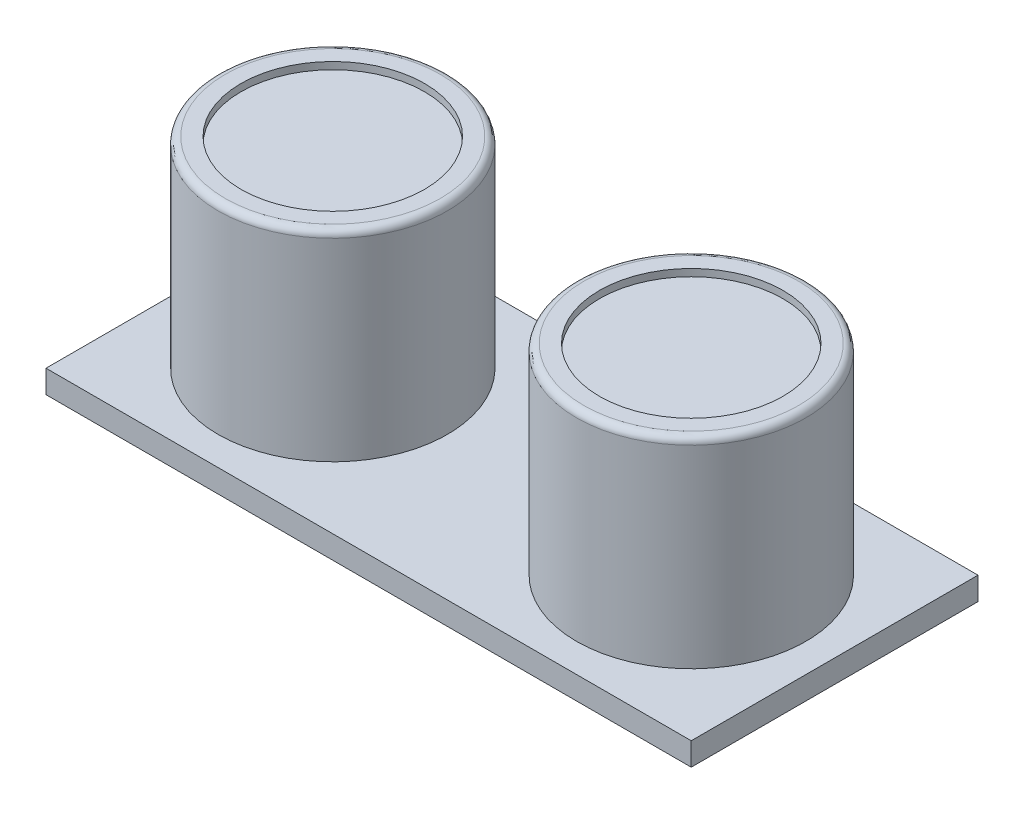
ISO-10303-21;
HEADER;
FILE_DESCRIPTION(('STEP AP214'),'2;1');
FILE_NAME('part.step','',(''),(''),'','','');
FILE_SCHEMA(('AUTOMOTIVE_DESIGN { 1 0 10303 214 1 1 1 1 }'));
ENDSEC;
DATA;
#1=APPLICATION_CONTEXT('core data for automotive mechanical design processes');
#2=APPLICATION_PROTOCOL_DEFINITION('international standard','automotive_design',2000,#1);
#3=PRODUCT_CONTEXT('',#1,'mechanical');
#4=PRODUCT('Part','Part','',(#3));
#5=PRODUCT_RELATED_PRODUCT_CATEGORY('part','',(#4));
#6=PRODUCT_DEFINITION_FORMATION('','',#4);
#7=PRODUCT_DEFINITION_CONTEXT('part definition',#1,'design');
#8=PRODUCT_DEFINITION('design','',#6,#7);
#9=PRODUCT_DEFINITION_SHAPE('','',#8);
#10=(LENGTH_UNIT() NAMED_UNIT(*) SI_UNIT(.MILLI.,.METRE.));
#11=(NAMED_UNIT(*) PLANE_ANGLE_UNIT() SI_UNIT($,.RADIAN.));
#12=(NAMED_UNIT(*) SI_UNIT($,.STERADIAN.) SOLID_ANGLE_UNIT());
#13=UNCERTAINTY_MEASURE_WITH_UNIT(LENGTH_MEASURE(1.E-05),#10,'distance_accuracy_value','');
#14=(GEOMETRIC_REPRESENTATION_CONTEXT(3) GLOBAL_UNCERTAINTY_ASSIGNED_CONTEXT((#13)) GLOBAL_UNIT_ASSIGNED_CONTEXT((#10,
#11,#12)) REPRESENTATION_CONTEXT('',''));
#15=CARTESIAN_POINT('',(0.,0.,0.));
#16=DIRECTION('',(0.,0.,1.));
#17=DIRECTION('',(1.,0.,0.));
#18=AXIS2_PLACEMENT_3D('',#15,#16,#17);
#19=CARTESIAN_POINT('',(0.,1.6,0.));
#20=DIRECTION('',(1.,0.,0.));
#21=DIRECTION('',(0.,0.,-1.));
#22=AXIS2_PLACEMENT_3D('',#19,#20,#21);
#23=PLANE('',#22);
#24=DIRECTION('',(0.,0.,1.));
#25=VECTOR('',#24,1.);
#26=CARTESIAN_POINT('',(0.,0.,0.));
#27=LINE('',#26,#25);
#28=CARTESIAN_POINT('',(0.,0.,-20.));
#29=VERTEX_POINT('',#28);
#30=CARTESIAN_POINT('',(0.,0.,0.));
#31=VERTEX_POINT('',#30);
#32=EDGE_CURVE('E102',#29,#31,#27,.T.);
#33=ORIENTED_EDGE('',*,*,#32,.T.);
#34=DIRECTION('',(0.,-1.,0.));
#35=VECTOR('',#34,1.);
#36=CARTESIAN_POINT('',(0.,1.6,0.));
#37=LINE('',#36,#35);
#38=CARTESIAN_POINT('',(0.,1.6,0.));
#39=VERTEX_POINT('',#38);
#40=EDGE_CURVE('E93',#39,#31,#37,.T.);
#41=ORIENTED_EDGE('',*,*,#40,.F.);
#42=DIRECTION('',(0.,0.,1.));
#43=VECTOR('',#42,1.);
#44=CARTESIAN_POINT('',(0.,1.6,0.));
#45=LINE('',#44,#43);
#46=CARTESIAN_POINT('',(0.,1.6,-20.));
#47=VERTEX_POINT('',#46);
#48=EDGE_CURVE('E87',#47,#39,#45,.T.);
#49=ORIENTED_EDGE('',*,*,#48,.F.);
#50=DIRECTION('',(0.,-1.,0.));
#51=VECTOR('',#50,1.);
#52=CARTESIAN_POINT('',(0.,1.6,-20.));
#53=LINE('',#52,#51);
#54=EDGE_CURVE('E98',#47,#29,#53,.T.);
#55=ORIENTED_EDGE('',*,*,#54,.T.);
#56=EDGE_LOOP('',(#33,#41,#49,#55));
#57=FACE_BOUND('',#56,.T.);
#58=ADVANCED_FACE('F34',(#57),#23,.F.);
#59=CARTESIAN_POINT('',(0.,1.6,0.));
#60=DIRECTION('',(0.,0.,-1.));
#61=DIRECTION('',(-1.,0.,0.));
#62=AXIS2_PLACEMENT_3D('',#59,#60,#61);
#63=PLANE('',#62);
#64=DIRECTION('',(1.,0.,0.));
#65=VECTOR('',#64,1.);
#66=CARTESIAN_POINT('',(0.,0.,0.));
#67=LINE('',#66,#65);
#68=CARTESIAN_POINT('',(45.,0.,0.));
#69=VERTEX_POINT('',#68);
#70=EDGE_CURVE('E92',#31,#69,#67,.T.);
#71=ORIENTED_EDGE('',*,*,#70,.T.);
#72=DIRECTION('',(0.,-1.,0.));
#73=VECTOR('',#72,1.);
#74=CARTESIAN_POINT('',(45.,1.6,0.));
#75=LINE('',#74,#73);
#76=CARTESIAN_POINT('',(45.,1.6,0.));
#77=VERTEX_POINT('',#76);
#78=EDGE_CURVE('E90',#77,#69,#75,.T.);
#79=ORIENTED_EDGE('',*,*,#78,.F.);
#80=DIRECTION('',(1.,0.,0.));
#81=VECTOR('',#80,1.);
#82=CARTESIAN_POINT('',(0.,1.6,0.));
#83=LINE('',#82,#81);
#84=EDGE_CURVE('E82',#39,#77,#83,.T.);
#85=ORIENTED_EDGE('',*,*,#84,.F.);
#86=ORIENTED_EDGE('',*,*,#40,.T.);
#87=EDGE_LOOP('',(#71,#79,#85,#86));
#88=FACE_BOUND('',#87,.T.);
#89=ADVANCED_FACE('F91',(#88),#63,.F.);
#90=CARTESIAN_POINT('',(45.,1.6,0.));
#91=DIRECTION('',(-1.,0.,0.));
#92=DIRECTION('',(0.,0.,1.));
#93=AXIS2_PLACEMENT_3D('',#90,#91,#92);
#94=PLANE('',#93);
#95=DIRECTION('',(0.,0.,-1.));
#96=VECTOR('',#95,1.);
#97=CARTESIAN_POINT('',(45.,0.,0.));
#98=LINE('',#97,#96);
#99=CARTESIAN_POINT('',(45.,0.,-20.));
#100=VERTEX_POINT('',#99);
#101=EDGE_CURVE('E68',#69,#100,#98,.T.);
#102=ORIENTED_EDGE('',*,*,#101,.T.);
#103=DIRECTION('',(0.,-1.,0.));
#104=VECTOR('',#103,1.);
#105=CARTESIAN_POINT('',(45.,1.6,-20.));
#106=LINE('',#105,#104);
#107=CARTESIAN_POINT('',(45.,1.6,-20.));
#108=VERTEX_POINT('',#107);
#109=EDGE_CURVE('E94',#108,#100,#106,.T.);
#110=ORIENTED_EDGE('',*,*,#109,.F.);
#111=DIRECTION('',(0.,0.,-1.));
#112=VECTOR('',#111,1.);
#113=CARTESIAN_POINT('',(45.,1.6,0.));
#114=LINE('',#113,#112);
#115=EDGE_CURVE('E85',#77,#108,#114,.T.);
#116=ORIENTED_EDGE('',*,*,#115,.F.);
#117=ORIENTED_EDGE('',*,*,#78,.T.);
#118=EDGE_LOOP('',(#102,#110,#116,#117));
#119=FACE_BOUND('',#118,.T.);
#120=ADVANCED_FACE('F96',(#119),#94,.F.);
#121=CARTESIAN_POINT('',(0.,1.6,-20.));
#122=DIRECTION('',(0.,0.,1.));
#123=DIRECTION('',(1.,0.,0.));
#124=AXIS2_PLACEMENT_3D('',#121,#122,#123);
#125=PLANE('',#124);
#126=DIRECTION('',(-1.,0.,0.));
#127=VECTOR('',#126,1.);
#128=CARTESIAN_POINT('',(0.,0.,-20.));
#129=LINE('',#128,#127);
#130=EDGE_CURVE('E74',#100,#29,#129,.T.);
#131=ORIENTED_EDGE('',*,*,#130,.T.);
#132=ORIENTED_EDGE('',*,*,#54,.F.);
#133=DIRECTION('',(-1.,0.,0.));
#134=VECTOR('',#133,1.);
#135=CARTESIAN_POINT('',(0.,1.6,-20.));
#136=LINE('',#135,#134);
#137=EDGE_CURVE('E51',#108,#47,#136,.T.);
#138=ORIENTED_EDGE('',*,*,#137,.F.);
#139=ORIENTED_EDGE('',*,*,#109,.T.);
#140=EDGE_LOOP('',(#131,#132,#138,#139));
#141=FACE_BOUND('',#140,.T.);
#142=ADVANCED_FACE('F148',(#141),#125,.F.);
#143=CARTESIAN_POINT('',(0.,1.6,0.));
#144=DIRECTION('',(0.,-1.,0.));
#145=DIRECTION('',(0.,0.,-1.));
#146=AXIS2_PLACEMENT_3D('',#143,#144,#145);
#147=PLANE('',#146);
#148=CARTESIAN_POINT('',(35.,1.6,-10.));
#149=DIRECTION('',(0.,-1.,0.));
#150=DIRECTION('',(0.,0.,-1.));
#151=AXIS2_PLACEMENT_3D('',#148,#149,#150);
#152=CIRCLE('',#151,8.);
#153=CARTESIAN_POINT('',(35.,1.6,-18.));
#154=VERTEX_POINT('',#153);
#155=EDGE_CURVE('E115',#154,#154,#152,.F.);
#156=ORIENTED_EDGE('',*,*,#155,.F.);
#157=EDGE_LOOP('',(#156));
#158=FACE_BOUND('',#157,.T.);
#159=CARTESIAN_POINT('',(10.,1.6,-10.));
#160=DIRECTION('',(0.,-1.,0.));
#161=DIRECTION('',(0.,0.,-1.));
#162=AXIS2_PLACEMENT_3D('',#159,#160,#161);
#163=CIRCLE('',#162,8.);
#164=CARTESIAN_POINT('',(10.,1.6,-18.));
#165=VERTEX_POINT('',#164);
#166=EDGE_CURVE('E112',#165,#165,#163,.F.);
#167=ORIENTED_EDGE('',*,*,#166,.F.);
#168=EDGE_LOOP('',(#167));
#169=FACE_BOUND('',#168,.T.);
#170=ORIENTED_EDGE('',*,*,#48,.T.);
#171=ORIENTED_EDGE('',*,*,#84,.T.);
#172=ORIENTED_EDGE('',*,*,#115,.T.);
#173=ORIENTED_EDGE('',*,*,#137,.T.);
#174=EDGE_LOOP('',(#170,#171,#172,#173));
#175=FACE_BOUND('',#174,.T.);
#176=ADVANCED_FACE('F83',(#158,#169,#175),#147,.F.);
#177=CARTESIAN_POINT('',(0.,0.,0.));
#178=DIRECTION('',(0.,-1.,0.));
#179=DIRECTION('',(0.,0.,-1.));
#180=AXIS2_PLACEMENT_3D('',#177,#178,#179);
#181=PLANE('',#180);
#182=ORIENTED_EDGE('',*,*,#32,.F.);
#183=ORIENTED_EDGE('',*,*,#130,.F.);
#184=ORIENTED_EDGE('',*,*,#101,.F.);
#185=ORIENTED_EDGE('',*,*,#70,.F.);
#186=EDGE_LOOP('',(#182,#183,#184,#185));
#187=FACE_BOUND('',#186,.T.);
#188=ADVANCED_FACE('F151',(#187),#181,.T.);
#189=CARTESIAN_POINT('',(10.,15.6,-10.));
#190=DIRECTION('',(0.,-1.,0.));
#191=DIRECTION('',(0.,0.,-1.));
#192=AXIS2_PLACEMENT_3D('',#189,#190,#191);
#193=CYLINDRICAL_SURFACE('',#192,8.);
#194=CARTESIAN_POINT('',(10.,15.1,-10.));
#195=DIRECTION('',(0.,1.,0.));
#196=DIRECTION('',(0.,0.,1.));
#197=AXIS2_PLACEMENT_3D('',#194,#195,#196);
#198=CIRCLE('',#197,8.);
#199=CARTESIAN_POINT('',(10.,15.1,-2.));
#200=VERTEX_POINT('',#199);
#201=EDGE_CURVE('E11',#200,#200,#198,.F.);
#202=ORIENTED_EDGE('',*,*,#201,.T.);
#203=EDGE_LOOP('',(#202));
#204=FACE_BOUND('',#203,.T.);
#205=ORIENTED_EDGE('',*,*,#166,.T.);
#206=EDGE_LOOP('',(#205));
#207=FACE_BOUND('',#206,.T.);
#208=ADVANCED_FACE('F154',(#204,#207),#193,.T.);
#209=CARTESIAN_POINT('',(10.,15.6,-10.));
#210=DIRECTION('',(0.,1.,0.));
#211=DIRECTION('',(0.,0.,1.));
#212=AXIS2_PLACEMENT_3D('',#209,#210,#211);
#213=PLANE('',#212);
#214=CARTESIAN_POINT('',(10.,15.6,-10.));
#215=DIRECTION('',(0.,1.,0.));
#216=DIRECTION('',(0.,0.,1.));
#217=AXIS2_PLACEMENT_3D('',#214,#215,#216);
#218=CIRCLE('',#217,7.5);
#219=CARTESIAN_POINT('',(10.,15.6,-2.5));
#220=VERTEX_POINT('',#219);
#221=EDGE_CURVE('E43',#220,#220,#218,.T.);
#222=ORIENTED_EDGE('',*,*,#221,.T.);
#223=EDGE_LOOP('',(#222));
#224=FACE_BOUND('',#223,.T.);
#225=CARTESIAN_POINT('',(10.,15.6,-10.));
#226=DIRECTION('',(0.,1.,0.));
#227=DIRECTION('',(0.,0.,1.));
#228=AXIS2_PLACEMENT_3D('',#225,#226,#227);
#229=CIRCLE('',#228,6.4);
#230=CARTESIAN_POINT('',(10.,15.6,-3.6));
#231=VERTEX_POINT('',#230);
#232=EDGE_CURVE('E190',#231,#231,#229,.T.);
#233=ORIENTED_EDGE('',*,*,#232,.F.);
#234=EDGE_LOOP('',(#233));
#235=FACE_BOUND('',#234,.T.);
#236=ADVANCED_FACE('F126',(#224,#235),#213,.T.);
#237=CARTESIAN_POINT('',(35.,15.6,-10.));
#238=DIRECTION('',(0.,-1.,0.));
#239=DIRECTION('',(0.,0.,-1.));
#240=AXIS2_PLACEMENT_3D('',#237,#238,#239);
#241=CYLINDRICAL_SURFACE('',#240,8.);
#242=CARTESIAN_POINT('',(35.,15.1,-10.));
#243=DIRECTION('',(0.,1.,0.));
#244=DIRECTION('',(0.,0.,1.));
#245=AXIS2_PLACEMENT_3D('',#242,#243,#244);
#246=CIRCLE('',#245,8.);
#247=CARTESIAN_POINT('',(35.,15.1,-2.));
#248=VERTEX_POINT('',#247);
#249=EDGE_CURVE('E121',#248,#248,#246,.F.);
#250=ORIENTED_EDGE('',*,*,#249,.T.);
#251=EDGE_LOOP('',(#250));
#252=FACE_BOUND('',#251,.T.);
#253=ORIENTED_EDGE('',*,*,#155,.T.);
#254=EDGE_LOOP('',(#253));
#255=FACE_BOUND('',#254,.T.);
#256=ADVANCED_FACE('F164',(#252,#255),#241,.T.);
#257=CARTESIAN_POINT('',(35.,15.6,-10.));
#258=DIRECTION('',(0.,1.,0.));
#259=DIRECTION('',(0.,0.,1.));
#260=AXIS2_PLACEMENT_3D('',#257,#258,#259);
#261=PLANE('',#260);
#262=CARTESIAN_POINT('',(35.,15.6,-10.));
#263=DIRECTION('',(0.,1.,0.));
#264=DIRECTION('',(0.,0.,1.));
#265=AXIS2_PLACEMENT_3D('',#262,#263,#264);
#266=CIRCLE('',#265,7.5);
#267=CARTESIAN_POINT('',(35.,15.6,-2.5));
#268=VERTEX_POINT('',#267);
#269=EDGE_CURVE('E118',#268,#268,#266,.T.);
#270=ORIENTED_EDGE('',*,*,#269,.T.);
#271=EDGE_LOOP('',(#270));
#272=FACE_BOUND('',#271,.T.);
#273=CARTESIAN_POINT('',(35.,15.6,-10.));
#274=DIRECTION('',(0.,1.,0.));
#275=DIRECTION('',(0.,0.,1.));
#276=AXIS2_PLACEMENT_3D('',#273,#274,#275);
#277=CIRCLE('',#276,6.39999999999999);
#278=CARTESIAN_POINT('',(35.,15.6,-3.60000000000001));
#279=VERTEX_POINT('',#278);
#280=EDGE_CURVE('E198',#279,#279,#277,.T.);
#281=ORIENTED_EDGE('',*,*,#280,.F.);
#282=EDGE_LOOP('',(#281));
#283=FACE_BOUND('',#282,.T.);
#284=ADVANCED_FACE('F167',(#272,#283),#261,.T.);
#285=CARTESIAN_POINT('',(35.,15.1,-10.));
#286=DIRECTION('',(0.,1.,0.));
#287=DIRECTION('',(0.,0.,1.));
#288=AXIS2_PLACEMENT_3D('',#285,#286,#287);
#289=CYLINDRICAL_SURFACE('',#288,6.39999999999999);
#290=CARTESIAN_POINT('',(35.,15.1,-10.));
#291=DIRECTION('',(0.,1.,0.));
#292=DIRECTION('',(0.,0.,1.));
#293=AXIS2_PLACEMENT_3D('',#290,#291,#292);
#294=CIRCLE('',#293,6.39999999999999);
#295=CARTESIAN_POINT('',(35.,15.1,-3.60000000000001));
#296=VERTEX_POINT('',#295);
#297=EDGE_CURVE('E193',#296,#296,#294,.T.);
#298=ORIENTED_EDGE('',*,*,#297,.F.);
#299=EDGE_LOOP('',(#298));
#300=FACE_BOUND('',#299,.T.);
#301=ORIENTED_EDGE('',*,*,#280,.T.);
#302=EDGE_LOOP('',(#301));
#303=FACE_BOUND('',#302,.T.);
#304=ADVANCED_FACE('F171',(#300,#303),#289,.F.);
#305=CARTESIAN_POINT('',(35.,15.1,-10.));
#306=DIRECTION('',(0.,1.,0.));
#307=DIRECTION('',(0.,0.,1.));
#308=AXIS2_PLACEMENT_3D('',#305,#306,#307);
#309=PLANE('',#308);
#310=ORIENTED_EDGE('',*,*,#297,.T.);
#311=EDGE_LOOP('',(#310));
#312=FACE_BOUND('',#311,.T.);
#313=ADVANCED_FACE('F175',(#312),#309,.T.);
#314=CARTESIAN_POINT('',(10.,15.1,-10.));
#315=DIRECTION('',(0.,1.,0.));
#316=DIRECTION('',(0.,0.,1.));
#317=AXIS2_PLACEMENT_3D('',#314,#315,#316);
#318=CYLINDRICAL_SURFACE('',#317,6.4);
#319=CARTESIAN_POINT('',(10.,15.1,-10.));
#320=DIRECTION('',(0.,1.,0.));
#321=DIRECTION('',(0.,0.,1.));
#322=AXIS2_PLACEMENT_3D('',#319,#320,#321);
#323=CIRCLE('',#322,6.4);
#324=CARTESIAN_POINT('',(10.,15.1,-3.6));
#325=VERTEX_POINT('',#324);
#326=EDGE_CURVE('E105',#325,#325,#323,.T.);
#327=ORIENTED_EDGE('',*,*,#326,.F.);
#328=EDGE_LOOP('',(#327));
#329=FACE_BOUND('',#328,.T.);
#330=ORIENTED_EDGE('',*,*,#232,.T.);
#331=EDGE_LOOP('',(#330));
#332=FACE_BOUND('',#331,.T.);
#333=ADVANCED_FACE('F179',(#329,#332),#318,.F.);
#334=CARTESIAN_POINT('',(10.,15.1,-10.));
#335=DIRECTION('',(0.,1.,0.));
#336=DIRECTION('',(0.,0.,1.));
#337=AXIS2_PLACEMENT_3D('',#334,#335,#336);
#338=PLANE('',#337);
#339=ORIENTED_EDGE('',*,*,#326,.T.);
#340=EDGE_LOOP('',(#339));
#341=FACE_BOUND('',#340,.T.);
#342=ADVANCED_FACE('F135',(#341),#338,.T.);
#343=CARTESIAN_POINT('',(35.,15.1,-10.));
#344=DIRECTION('',(0.,1.,0.));
#345=DIRECTION('',(0.,0.,1.));
#346=AXIS2_PLACEMENT_3D('',#343,#344,#345);
#347=TOROIDAL_SURFACE('',#346,7.5,0.5);
#348=ORIENTED_EDGE('',*,*,#249,.F.);
#349=EDGE_LOOP('',(#348));
#350=FACE_BOUND('',#349,.T.);
#351=ORIENTED_EDGE('',*,*,#269,.F.);
#352=EDGE_LOOP('',(#351));
#353=FACE_BOUND('',#352,.T.);
#354=ADVANCED_FACE('F130',(#350,#353),#347,.T.);
#355=CARTESIAN_POINT('',(10.,15.1,-10.));
#356=DIRECTION('',(0.,1.,0.));
#357=DIRECTION('',(0.,0.,1.));
#358=AXIS2_PLACEMENT_3D('',#355,#356,#357);
#359=TOROIDAL_SURFACE('',#358,7.5,0.5);
#360=ORIENTED_EDGE('',*,*,#201,.F.);
#361=EDGE_LOOP('',(#360));
#362=FACE_BOUND('',#361,.T.);
#363=ORIENTED_EDGE('',*,*,#221,.F.);
#364=EDGE_LOOP('',(#363));
#365=FACE_BOUND('',#364,.T.);
#366=ADVANCED_FACE('F36',(#362,#365),#359,.T.);
#367=CLOSED_SHELL('',(#58,#89,#120,#142,#176,#188,#208,#236,#256,#284,#304,#313,#333,#342,#354,#366));
#368=MANIFOLD_SOLID_BREP('B2',#367);
#369=ADVANCED_BREP_SHAPE_REPRESENTATION('',(#18,#368),#14);
#370=SHAPE_DEFINITION_REPRESENTATION(#9,#369);
ENDSEC;
END-ISO-10303-21;
